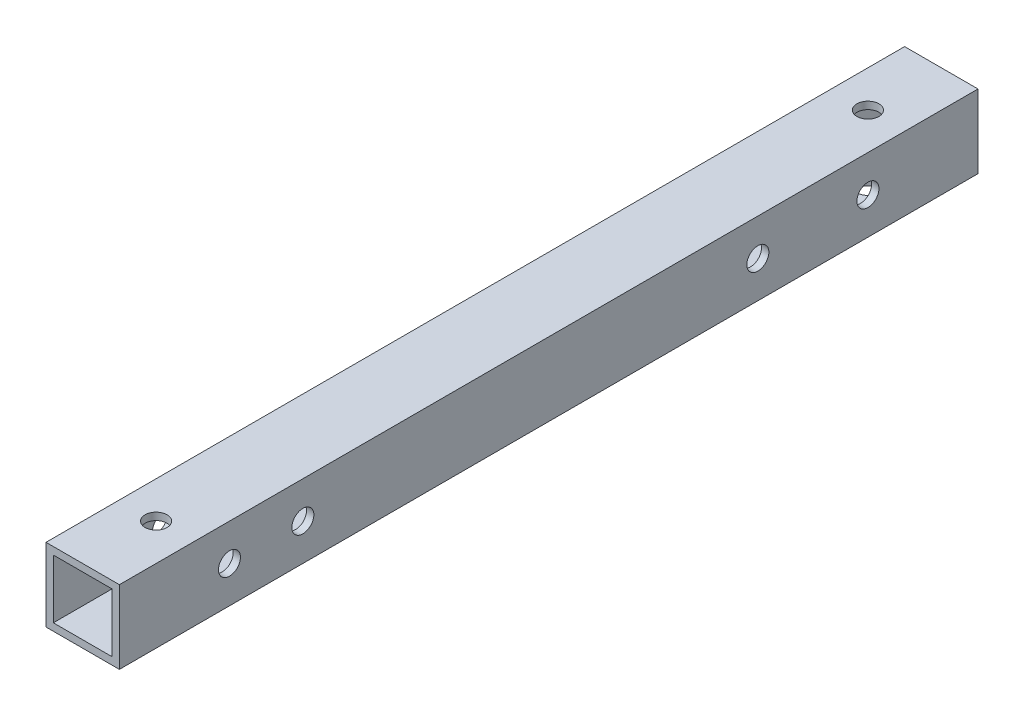
ISO-10303-21;
HEADER;
FILE_DESCRIPTION(('STEP AP214'),'2;1');
FILE_NAME('part.step','',(''),(''),'','','');
FILE_SCHEMA(('AUTOMOTIVE_DESIGN { 1 0 10303 214 1 1 1 1 }'));
ENDSEC;
DATA;
#1=APPLICATION_CONTEXT('core data for automotive mechanical design processes');
#2=APPLICATION_PROTOCOL_DEFINITION('international standard','automotive_design',2000,#1);
#3=PRODUCT_CONTEXT('',#1,'mechanical');
#4=PRODUCT('Part','Part','',(#3));
#5=PRODUCT_RELATED_PRODUCT_CATEGORY('part','',(#4));
#6=PRODUCT_DEFINITION_FORMATION('','',#4);
#7=PRODUCT_DEFINITION_CONTEXT('part definition',#1,'design');
#8=PRODUCT_DEFINITION('design','',#6,#7);
#9=PRODUCT_DEFINITION_SHAPE('','',#8);
#10=(LENGTH_UNIT() NAMED_UNIT(*) SI_UNIT(.MILLI.,.METRE.));
#11=(NAMED_UNIT(*) PLANE_ANGLE_UNIT() SI_UNIT($,.RADIAN.));
#12=(NAMED_UNIT(*) SI_UNIT($,.STERADIAN.) SOLID_ANGLE_UNIT());
#13=UNCERTAINTY_MEASURE_WITH_UNIT(LENGTH_MEASURE(1.E-05),#10,'distance_accuracy_value','');
#14=(GEOMETRIC_REPRESENTATION_CONTEXT(3) GLOBAL_UNCERTAINTY_ASSIGNED_CONTEXT((#13)) GLOBAL_UNIT_ASSIGNED_CONTEXT((#10,
#11,#12)) REPRESENTATION_CONTEXT('',''));
#15=CARTESIAN_POINT('',(0.,0.,0.));
#16=DIRECTION('',(0.,0.,1.));
#17=DIRECTION('',(1.,0.,0.));
#18=AXIS2_PLACEMENT_3D('',#15,#16,#17);
#19=CARTESIAN_POINT('',(0.,0.,117.));
#20=DIRECTION('',(0.,0.,1.));
#21=DIRECTION('',(1.,0.,0.));
#22=AXIS2_PLACEMENT_3D('',#19,#20,#21);
#23=PLANE('',#22);
#24=DIRECTION('',(0.,-1.,0.));
#25=VECTOR('',#24,1.);
#26=CARTESIAN_POINT('',(-5.,5.,117.));
#27=LINE('',#26,#25);
#28=CARTESIAN_POINT('',(-5.,5.,117.));
#29=VERTEX_POINT('',#28);
#30=CARTESIAN_POINT('',(-5.,-5.,117.));
#31=VERTEX_POINT('',#30);
#32=EDGE_CURVE('E168',#29,#31,#27,.T.);
#33=ORIENTED_EDGE('',*,*,#32,.T.);
#34=DIRECTION('',(1.,0.,0.));
#35=VECTOR('',#34,1.);
#36=CARTESIAN_POINT('',(-5.,-5.,117.));
#37=LINE('',#36,#35);
#38=CARTESIAN_POINT('',(5.,-5.,117.));
#39=VERTEX_POINT('',#38);
#40=EDGE_CURVE('E171',#31,#39,#37,.T.);
#41=ORIENTED_EDGE('',*,*,#40,.T.);
#42=DIRECTION('',(0.,1.,0.));
#43=VECTOR('',#42,1.);
#44=CARTESIAN_POINT('',(5.,5.,117.));
#45=LINE('',#44,#43);
#46=CARTESIAN_POINT('',(5.,5.,117.));
#47=VERTEX_POINT('',#46);
#48=EDGE_CURVE('E174',#39,#47,#45,.T.);
#49=ORIENTED_EDGE('',*,*,#48,.T.);
#50=DIRECTION('',(-1.,0.,0.));
#51=VECTOR('',#50,1.);
#52=CARTESIAN_POINT('',(-5.,5.,117.));
#53=LINE('',#52,#51);
#54=EDGE_CURVE('E176',#47,#29,#53,.T.);
#55=ORIENTED_EDGE('',*,*,#54,.T.);
#56=EDGE_LOOP('',(#33,#41,#49,#55));
#57=FACE_BOUND('',#56,.T.);
#58=DIRECTION('',(1.,0.,0.));
#59=VECTOR('',#58,1.);
#60=CARTESIAN_POINT('',(-5.,-4.,117.));
#61=LINE('',#60,#59);
#62=CARTESIAN_POINT('',(-4.,-4.,117.));
#63=VERTEX_POINT('',#62);
#64=CARTESIAN_POINT('',(4.,-4.,117.));
#65=VERTEX_POINT('',#64);
#66=EDGE_CURVE('E138',#63,#65,#61,.T.);
#67=ORIENTED_EDGE('',*,*,#66,.F.);
#68=DIRECTION('',(0.,-1.,0.));
#69=VECTOR('',#68,1.);
#70=CARTESIAN_POINT('',(-4.,5.,117.));
#71=LINE('',#70,#69);
#72=CARTESIAN_POINT('',(-4.,4.,117.));
#73=VERTEX_POINT('',#72);
#74=EDGE_CURVE('E130',#73,#63,#71,.T.);
#75=ORIENTED_EDGE('',*,*,#74,.F.);
#76=DIRECTION('',(-1.,0.,0.));
#77=VECTOR('',#76,1.);
#78=CARTESIAN_POINT('',(-5.,4.,117.));
#79=LINE('',#78,#77);
#80=CARTESIAN_POINT('',(4.,4.,117.));
#81=VERTEX_POINT('',#80);
#82=EDGE_CURVE('E152',#81,#73,#79,.T.);
#83=ORIENTED_EDGE('',*,*,#82,.F.);
#84=DIRECTION('',(0.,1.,0.));
#85=VECTOR('',#84,1.);
#86=CARTESIAN_POINT('',(4.,5.,117.));
#87=LINE('',#86,#85);
#88=EDGE_CURVE('E150',#65,#81,#87,.T.);
#89=ORIENTED_EDGE('',*,*,#88,.F.);
#90=EDGE_LOOP('',(#67,#75,#83,#89));
#91=FACE_BOUND('',#90,.T.);
#92=ADVANCED_FACE('F63',(#57,#91),#23,.T.);
#93=CARTESIAN_POINT('',(0.,0.,0.));
#94=DIRECTION('',(0.,0.,1.));
#95=DIRECTION('',(1.,0.,0.));
#96=AXIS2_PLACEMENT_3D('',#93,#94,#95);
#97=PLANE('',#96);
#98=DIRECTION('',(0.,-1.,0.));
#99=VECTOR('',#98,1.);
#100=CARTESIAN_POINT('',(-5.,5.,0.));
#101=LINE('',#100,#99);
#102=CARTESIAN_POINT('',(-5.,5.,0.));
#103=VERTEX_POINT('',#102);
#104=CARTESIAN_POINT('',(-5.,-5.,0.));
#105=VERTEX_POINT('',#104);
#106=EDGE_CURVE('E146',#103,#105,#101,.T.);
#107=ORIENTED_EDGE('',*,*,#106,.F.);
#108=DIRECTION('',(-1.,0.,0.));
#109=VECTOR('',#108,1.);
#110=CARTESIAN_POINT('',(-5.,5.,0.));
#111=LINE('',#110,#109);
#112=CARTESIAN_POINT('',(5.,5.,0.));
#113=VERTEX_POINT('',#112);
#114=EDGE_CURVE('E172',#113,#103,#111,.T.);
#115=ORIENTED_EDGE('',*,*,#114,.F.);
#116=DIRECTION('',(0.,1.,0.));
#117=VECTOR('',#116,1.);
#118=CARTESIAN_POINT('',(5.,5.,0.));
#119=LINE('',#118,#117);
#120=CARTESIAN_POINT('',(5.,-5.,0.));
#121=VERTEX_POINT('',#120);
#122=EDGE_CURVE('E183',#121,#113,#119,.T.);
#123=ORIENTED_EDGE('',*,*,#122,.F.);
#124=DIRECTION('',(1.,0.,0.));
#125=VECTOR('',#124,1.);
#126=CARTESIAN_POINT('',(-5.,-5.,0.));
#127=LINE('',#126,#125);
#128=EDGE_CURVE('E181',#105,#121,#127,.T.);
#129=ORIENTED_EDGE('',*,*,#128,.F.);
#130=EDGE_LOOP('',(#107,#115,#123,#129));
#131=FACE_BOUND('',#130,.T.);
#132=DIRECTION('',(0.,-1.,0.));
#133=VECTOR('',#132,1.);
#134=CARTESIAN_POINT('',(-4.,5.,0.));
#135=LINE('',#134,#133);
#136=CARTESIAN_POINT('',(-4.,4.,0.));
#137=VERTEX_POINT('',#136);
#138=CARTESIAN_POINT('',(-4.,-4.,0.));
#139=VERTEX_POINT('',#138);
#140=EDGE_CURVE('E88',#137,#139,#135,.T.);
#141=ORIENTED_EDGE('',*,*,#140,.T.);
#142=DIRECTION('',(1.,0.,0.));
#143=VECTOR('',#142,1.);
#144=CARTESIAN_POINT('',(-5.,-4.,0.));
#145=LINE('',#144,#143);
#146=CARTESIAN_POINT('',(4.,-4.,0.));
#147=VERTEX_POINT('',#146);
#148=EDGE_CURVE('E145',#139,#147,#145,.T.);
#149=ORIENTED_EDGE('',*,*,#148,.T.);
#150=DIRECTION('',(0.,1.,0.));
#151=VECTOR('',#150,1.);
#152=CARTESIAN_POINT('',(4.,5.,0.));
#153=LINE('',#152,#151);
#154=CARTESIAN_POINT('',(4.,4.,0.));
#155=VERTEX_POINT('',#154);
#156=EDGE_CURVE('E160',#147,#155,#153,.T.);
#157=ORIENTED_EDGE('',*,*,#156,.T.);
#158=DIRECTION('',(-1.,0.,0.));
#159=VECTOR('',#158,1.);
#160=CARTESIAN_POINT('',(-5.,4.,0.));
#161=LINE('',#160,#159);
#162=EDGE_CURVE('E139',#155,#137,#161,.T.);
#163=ORIENTED_EDGE('',*,*,#162,.T.);
#164=EDGE_LOOP('',(#141,#149,#157,#163));
#165=FACE_BOUND('',#164,.T.);
#166=ADVANCED_FACE('F272',(#131,#165),#97,.F.);
#167=CARTESIAN_POINT('',(-5.,5.,117.));
#168=DIRECTION('',(1.,0.,0.));
#169=DIRECTION('',(0.,0.,-1.));
#170=AXIS2_PLACEMENT_3D('',#167,#168,#169);
#171=PLANE('',#170);
#172=CARTESIAN_POINT('',(-5.,0.,15.));
#173=DIRECTION('',(1.,0.,0.));
#174=DIRECTION('',(0.,0.,-1.));
#175=AXIS2_PLACEMENT_3D('',#172,#173,#174);
#176=CIRCLE('',#175,1.5);
#177=CARTESIAN_POINT('',(-5.,0.,13.5));
#178=VERTEX_POINT('',#177);
#179=EDGE_CURVE('E205',#178,#178,#176,.T.);
#180=ORIENTED_EDGE('',*,*,#179,.T.);
#181=EDGE_LOOP('',(#180));
#182=FACE_BOUND('',#181,.T.);
#183=CARTESIAN_POINT('',(-5.,0.,92.));
#184=DIRECTION('',(1.,0.,0.));
#185=DIRECTION('',(0.,0.,-1.));
#186=AXIS2_PLACEMENT_3D('',#183,#184,#185);
#187=CIRCLE('',#186,1.5);
#188=CARTESIAN_POINT('',(-5.,0.,90.5));
#189=VERTEX_POINT('',#188);
#190=EDGE_CURVE('E318',#189,#189,#187,.T.);
#191=ORIENTED_EDGE('',*,*,#190,.T.);
#192=EDGE_LOOP('',(#191));
#193=FACE_BOUND('',#192,.T.);
#194=CARTESIAN_POINT('',(-5.,0.,102.));
#195=DIRECTION('',(1.,0.,0.));
#196=DIRECTION('',(0.,0.,-1.));
#197=AXIS2_PLACEMENT_3D('',#194,#195,#196);
#198=CIRCLE('',#197,1.5);
#199=CARTESIAN_POINT('',(-5.,0.,100.5));
#200=VERTEX_POINT('',#199);
#201=EDGE_CURVE('E321',#200,#200,#198,.T.);
#202=ORIENTED_EDGE('',*,*,#201,.T.);
#203=EDGE_LOOP('',(#202));
#204=FACE_BOUND('',#203,.T.);
#205=CARTESIAN_POINT('',(-5.,0.,30.));
#206=DIRECTION('',(1.,0.,0.));
#207=DIRECTION('',(0.,0.,-1.));
#208=AXIS2_PLACEMENT_3D('',#205,#206,#207);
#209=CIRCLE('',#208,1.5);
#210=CARTESIAN_POINT('',(-5.,0.,28.5));
#211=VERTEX_POINT('',#210);
#212=EDGE_CURVE('E312',#211,#211,#209,.T.);
#213=ORIENTED_EDGE('',*,*,#212,.T.);
#214=EDGE_LOOP('',(#213));
#215=FACE_BOUND('',#214,.T.);
#216=ORIENTED_EDGE('',*,*,#106,.T.);
#217=DIRECTION('',(0.,0.,-1.));
#218=VECTOR('',#217,1.);
#219=CARTESIAN_POINT('',(-5.,-5.,117.));
#220=LINE('',#219,#218);
#221=EDGE_CURVE('E12',#31,#105,#220,.T.);
#222=ORIENTED_EDGE('',*,*,#221,.F.);
#223=ORIENTED_EDGE('',*,*,#32,.F.);
#224=DIRECTION('',(0.,0.,-1.));
#225=VECTOR('',#224,1.);
#226=CARTESIAN_POINT('',(-5.,5.,117.));
#227=LINE('',#226,#225);
#228=EDGE_CURVE('E178',#29,#103,#227,.T.);
#229=ORIENTED_EDGE('',*,*,#228,.T.);
#230=EDGE_LOOP('',(#216,#222,#223,#229));
#231=FACE_BOUND('',#230,.T.);
#232=ADVANCED_FACE('F65',(#182,#193,#204,#215,#231),#171,.F.);
#233=CARTESIAN_POINT('',(-5.,-5.,117.));
#234=DIRECTION('',(0.,1.,0.));
#235=DIRECTION('',(0.,0.,1.));
#236=AXIS2_PLACEMENT_3D('',#233,#234,#235);
#237=PLANE('',#236);
#238=CARTESIAN_POINT('',(0.,-5.,9.99999999999999));
#239=DIRECTION('',(0.,1.,0.));
#240=DIRECTION('',(0.,0.,1.));
#241=AXIS2_PLACEMENT_3D('',#238,#239,#240);
#242=CIRCLE('',#241,1.5);
#243=CARTESIAN_POINT('',(0.,-5.,11.5));
#244=VERTEX_POINT('',#243);
#245=EDGE_CURVE('E197',#244,#244,#242,.T.);
#246=ORIENTED_EDGE('',*,*,#245,.T.);
#247=EDGE_LOOP('',(#246));
#248=FACE_BOUND('',#247,.T.);
#249=CARTESIAN_POINT('',(0.,-5.,107.));
#250=DIRECTION('',(0.,1.,0.));
#251=DIRECTION('',(0.,0.,1.));
#252=AXIS2_PLACEMENT_3D('',#249,#250,#251);
#253=CIRCLE('',#252,1.5);
#254=CARTESIAN_POINT('',(0.,-5.,108.5));
#255=VERTEX_POINT('',#254);
#256=EDGE_CURVE('E226',#255,#255,#253,.T.);
#257=ORIENTED_EDGE('',*,*,#256,.T.);
#258=EDGE_LOOP('',(#257));
#259=FACE_BOUND('',#258,.T.);
#260=ORIENTED_EDGE('',*,*,#128,.T.);
#261=DIRECTION('',(0.,0.,-1.));
#262=VECTOR('',#261,1.);
#263=CARTESIAN_POINT('',(5.,-5.,117.));
#264=LINE('',#263,#262);
#265=EDGE_CURVE('E72',#39,#121,#264,.T.);
#266=ORIENTED_EDGE('',*,*,#265,.F.);
#267=ORIENTED_EDGE('',*,*,#40,.F.);
#268=ORIENTED_EDGE('',*,*,#221,.T.);
#269=EDGE_LOOP('',(#260,#266,#267,#268));
#270=FACE_BOUND('',#269,.T.);
#271=ADVANCED_FACE('F258',(#248,#259,#270),#237,.F.);
#272=CARTESIAN_POINT('',(5.,5.,117.));
#273=DIRECTION('',(-1.,0.,0.));
#274=DIRECTION('',(0.,0.,1.));
#275=AXIS2_PLACEMENT_3D('',#272,#273,#274);
#276=PLANE('',#275);
#277=CARTESIAN_POINT('',(5.,0.,15.));
#278=DIRECTION('',(1.,0.,0.));
#279=DIRECTION('',(0.,0.,-1.));
#280=AXIS2_PLACEMENT_3D('',#277,#278,#279);
#281=CIRCLE('',#280,1.5);
#282=CARTESIAN_POINT('',(5.,0.,13.5));
#283=VERTEX_POINT('',#282);
#284=EDGE_CURVE('E299',#283,#283,#281,.T.);
#285=ORIENTED_EDGE('',*,*,#284,.F.);
#286=EDGE_LOOP('',(#285));
#287=FACE_BOUND('',#286,.T.);
#288=CARTESIAN_POINT('',(5.,0.,92.));
#289=DIRECTION('',(1.,0.,0.));
#290=DIRECTION('',(0.,0.,-1.));
#291=AXIS2_PLACEMENT_3D('',#288,#289,#290);
#292=CIRCLE('',#291,1.5);
#293=CARTESIAN_POINT('',(5.,0.,90.5));
#294=VERTEX_POINT('',#293);
#295=EDGE_CURVE('E303',#294,#294,#292,.T.);
#296=ORIENTED_EDGE('',*,*,#295,.F.);
#297=EDGE_LOOP('',(#296));
#298=FACE_BOUND('',#297,.T.);
#299=CARTESIAN_POINT('',(5.,0.,102.));
#300=DIRECTION('',(1.,0.,0.));
#301=DIRECTION('',(0.,0.,-1.));
#302=AXIS2_PLACEMENT_3D('',#299,#300,#301);
#303=CIRCLE('',#302,1.5);
#304=CARTESIAN_POINT('',(5.,0.,100.5));
#305=VERTEX_POINT('',#304);
#306=EDGE_CURVE('E307',#305,#305,#303,.T.);
#307=ORIENTED_EDGE('',*,*,#306,.F.);
#308=EDGE_LOOP('',(#307));
#309=FACE_BOUND('',#308,.T.);
#310=CARTESIAN_POINT('',(5.,0.,30.));
#311=DIRECTION('',(1.,0.,0.));
#312=DIRECTION('',(0.,0.,-1.));
#313=AXIS2_PLACEMENT_3D('',#310,#311,#312);
#314=CIRCLE('',#313,1.5);
#315=CARTESIAN_POINT('',(5.,0.,28.5));
#316=VERTEX_POINT('',#315);
#317=EDGE_CURVE('E310',#316,#316,#314,.T.);
#318=ORIENTED_EDGE('',*,*,#317,.F.);
#319=EDGE_LOOP('',(#318));
#320=FACE_BOUND('',#319,.T.);
#321=ORIENTED_EDGE('',*,*,#122,.T.);
#322=DIRECTION('',(0.,0.,-1.));
#323=VECTOR('',#322,1.);
#324=CARTESIAN_POINT('',(5.,5.,117.));
#325=LINE('',#324,#323);
#326=EDGE_CURVE('E188',#47,#113,#325,.T.);
#327=ORIENTED_EDGE('',*,*,#326,.F.);
#328=ORIENTED_EDGE('',*,*,#48,.F.);
#329=ORIENTED_EDGE('',*,*,#265,.T.);
#330=EDGE_LOOP('',(#321,#327,#328,#329));
#331=FACE_BOUND('',#330,.T.);
#332=ADVANCED_FACE('F261',(#287,#298,#309,#320,#331),#276,.F.);
#333=CARTESIAN_POINT('',(-5.,5.,117.));
#334=DIRECTION('',(0.,-1.,0.));
#335=DIRECTION('',(0.,0.,-1.));
#336=AXIS2_PLACEMENT_3D('',#333,#334,#335);
#337=PLANE('',#336);
#338=CARTESIAN_POINT('',(0.,5.,9.99999999999999));
#339=DIRECTION('',(0.,1.,0.));
#340=DIRECTION('',(0.,0.,1.));
#341=AXIS2_PLACEMENT_3D('',#338,#339,#340);
#342=CIRCLE('',#341,1.5);
#343=CARTESIAN_POINT('',(0.,5.,11.5));
#344=VERTEX_POINT('',#343);
#345=EDGE_CURVE('E229',#344,#344,#342,.T.);
#346=ORIENTED_EDGE('',*,*,#345,.F.);
#347=EDGE_LOOP('',(#346));
#348=FACE_BOUND('',#347,.T.);
#349=CARTESIAN_POINT('',(0.,5.,107.));
#350=DIRECTION('',(0.,1.,0.));
#351=DIRECTION('',(0.,0.,1.));
#352=AXIS2_PLACEMENT_3D('',#349,#350,#351);
#353=CIRCLE('',#352,1.5);
#354=CARTESIAN_POINT('',(0.,5.,108.5));
#355=VERTEX_POINT('',#354);
#356=EDGE_CURVE('E232',#355,#355,#353,.T.);
#357=ORIENTED_EDGE('',*,*,#356,.F.);
#358=EDGE_LOOP('',(#357));
#359=FACE_BOUND('',#358,.T.);
#360=ORIENTED_EDGE('',*,*,#114,.T.);
#361=ORIENTED_EDGE('',*,*,#228,.F.);
#362=ORIENTED_EDGE('',*,*,#54,.F.);
#363=ORIENTED_EDGE('',*,*,#326,.T.);
#364=EDGE_LOOP('',(#360,#361,#362,#363));
#365=FACE_BOUND('',#364,.T.);
#366=ADVANCED_FACE('F276',(#348,#359,#365),#337,.F.);
#367=CARTESIAN_POINT('',(-4.,5.,117.));
#368=DIRECTION('',(1.,0.,0.));
#369=DIRECTION('',(0.,0.,-1.));
#370=AXIS2_PLACEMENT_3D('',#367,#368,#369);
#371=PLANE('',#370);
#372=CARTESIAN_POINT('',(-4.,0.,15.));
#373=DIRECTION('',(1.,0.,0.));
#374=DIRECTION('',(0.,0.,-1.));
#375=AXIS2_PLACEMENT_3D('',#372,#373,#374);
#376=CIRCLE('',#375,1.5);
#377=CARTESIAN_POINT('',(-4.,0.,13.5));
#378=VERTEX_POINT('',#377);
#379=EDGE_CURVE('E223',#378,#378,#376,.T.);
#380=ORIENTED_EDGE('',*,*,#379,.F.);
#381=EDGE_LOOP('',(#380));
#382=FACE_BOUND('',#381,.T.);
#383=CARTESIAN_POINT('',(-4.,0.,92.));
#384=DIRECTION('',(1.,0.,0.));
#385=DIRECTION('',(0.,0.,-1.));
#386=AXIS2_PLACEMENT_3D('',#383,#384,#385);
#387=CIRCLE('',#386,1.5);
#388=CARTESIAN_POINT('',(-4.,0.,90.5));
#389=VERTEX_POINT('',#388);
#390=EDGE_CURVE('E211',#389,#389,#387,.T.);
#391=ORIENTED_EDGE('',*,*,#390,.F.);
#392=EDGE_LOOP('',(#391));
#393=FACE_BOUND('',#392,.T.);
#394=CARTESIAN_POINT('',(-4.,0.,102.));
#395=DIRECTION('',(1.,0.,0.));
#396=DIRECTION('',(0.,0.,-1.));
#397=AXIS2_PLACEMENT_3D('',#394,#395,#396);
#398=CIRCLE('',#397,1.5);
#399=CARTESIAN_POINT('',(-4.,0.,100.5));
#400=VERTEX_POINT('',#399);
#401=EDGE_CURVE('E208',#400,#400,#398,.T.);
#402=ORIENTED_EDGE('',*,*,#401,.F.);
#403=EDGE_LOOP('',(#402));
#404=FACE_BOUND('',#403,.T.);
#405=CARTESIAN_POINT('',(-4.,0.,30.));
#406=DIRECTION('',(1.,0.,0.));
#407=DIRECTION('',(0.,0.,-1.));
#408=AXIS2_PLACEMENT_3D('',#405,#406,#407);
#409=CIRCLE('',#408,1.5);
#410=CARTESIAN_POINT('',(-4.,0.,28.5));
#411=VERTEX_POINT('',#410);
#412=EDGE_CURVE('E204',#411,#411,#409,.T.);
#413=ORIENTED_EDGE('',*,*,#412,.F.);
#414=EDGE_LOOP('',(#413));
#415=FACE_BOUND('',#414,.T.);
#416=ORIENTED_EDGE('',*,*,#140,.F.);
#417=DIRECTION('',(0.,0.,-1.));
#418=VECTOR('',#417,1.);
#419=CARTESIAN_POINT('',(-4.,4.,117.));
#420=LINE('',#419,#418);
#421=EDGE_CURVE('E134',#73,#137,#420,.T.);
#422=ORIENTED_EDGE('',*,*,#421,.F.);
#423=ORIENTED_EDGE('',*,*,#74,.T.);
#424=DIRECTION('',(0.,0.,-1.));
#425=VECTOR('',#424,1.);
#426=CARTESIAN_POINT('',(-4.,-4.,117.));
#427=LINE('',#426,#425);
#428=EDGE_CURVE('E133',#63,#139,#427,.T.);
#429=ORIENTED_EDGE('',*,*,#428,.T.);
#430=EDGE_LOOP('',(#416,#422,#423,#429));
#431=FACE_BOUND('',#430,.T.);
#432=ADVANCED_FACE('F132',(#382,#393,#404,#415,#431),#371,.T.);
#433=CARTESIAN_POINT('',(-5.,-4.,117.));
#434=DIRECTION('',(0.,1.,0.));
#435=DIRECTION('',(0.,0.,1.));
#436=AXIS2_PLACEMENT_3D('',#433,#434,#435);
#437=PLANE('',#436);
#438=CARTESIAN_POINT('',(0.,-4.,9.99999999999999));
#439=DIRECTION('',(0.,1.,0.));
#440=DIRECTION('',(0.,0.,1.));
#441=AXIS2_PLACEMENT_3D('',#438,#439,#440);
#442=CIRCLE('',#441,1.5);
#443=CARTESIAN_POINT('',(0.,-4.,11.5));
#444=VERTEX_POINT('',#443);
#445=EDGE_CURVE('E158',#444,#444,#442,.T.);
#446=ORIENTED_EDGE('',*,*,#445,.F.);
#447=EDGE_LOOP('',(#446));
#448=FACE_BOUND('',#447,.T.);
#449=CARTESIAN_POINT('',(0.,-4.,107.));
#450=DIRECTION('',(0.,1.,0.));
#451=DIRECTION('',(0.,0.,1.));
#452=AXIS2_PLACEMENT_3D('',#449,#450,#451);
#453=CIRCLE('',#452,1.5);
#454=CARTESIAN_POINT('',(0.,-4.,108.5));
#455=VERTEX_POINT('',#454);
#456=EDGE_CURVE('E196',#455,#455,#453,.T.);
#457=ORIENTED_EDGE('',*,*,#456,.F.);
#458=EDGE_LOOP('',(#457));
#459=FACE_BOUND('',#458,.T.);
#460=ORIENTED_EDGE('',*,*,#148,.F.);
#461=ORIENTED_EDGE('',*,*,#428,.F.);
#462=ORIENTED_EDGE('',*,*,#66,.T.);
#463=DIRECTION('',(0.,0.,-1.));
#464=VECTOR('',#463,1.);
#465=CARTESIAN_POINT('',(4.,-4.,117.));
#466=LINE('',#465,#464);
#467=EDGE_CURVE('E147',#65,#147,#466,.T.);
#468=ORIENTED_EDGE('',*,*,#467,.T.);
#469=EDGE_LOOP('',(#460,#461,#462,#468));
#470=FACE_BOUND('',#469,.T.);
#471=ADVANCED_FACE('F142',(#448,#459,#470),#437,.T.);
#472=CARTESIAN_POINT('',(4.,5.,117.));
#473=DIRECTION('',(-1.,0.,0.));
#474=DIRECTION('',(0.,0.,1.));
#475=AXIS2_PLACEMENT_3D('',#472,#473,#474);
#476=PLANE('',#475);
#477=CARTESIAN_POINT('',(4.00000000000001,0.,15.));
#478=DIRECTION('',(-1.,0.,0.));
#479=DIRECTION('',(0.,0.,1.));
#480=AXIS2_PLACEMENT_3D('',#477,#478,#479);
#481=CIRCLE('',#480,1.5);
#482=CARTESIAN_POINT('',(4.00000000000001,0.,16.5));
#483=VERTEX_POINT('',#482);
#484=EDGE_CURVE('E67',#483,#483,#481,.T.);
#485=ORIENTED_EDGE('',*,*,#484,.F.);
#486=EDGE_LOOP('',(#485));
#487=FACE_BOUND('',#486,.T.);
#488=CARTESIAN_POINT('',(4.00000000000001,0.,92.));
#489=DIRECTION('',(-1.,0.,0.));
#490=DIRECTION('',(0.,0.,1.));
#491=AXIS2_PLACEMENT_3D('',#488,#489,#490);
#492=CIRCLE('',#491,1.5);
#493=CARTESIAN_POINT('',(4.00000000000001,0.,93.5));
#494=VERTEX_POINT('',#493);
#495=EDGE_CURVE('E209',#494,#494,#492,.T.);
#496=ORIENTED_EDGE('',*,*,#495,.F.);
#497=EDGE_LOOP('',(#496));
#498=FACE_BOUND('',#497,.T.);
#499=CARTESIAN_POINT('',(4.00000000000001,0.,102.));
#500=DIRECTION('',(-1.,0.,0.));
#501=DIRECTION('',(0.,0.,1.));
#502=AXIS2_PLACEMENT_3D('',#499,#500,#501);
#503=CIRCLE('',#502,1.5);
#504=CARTESIAN_POINT('',(4.00000000000001,0.,103.5));
#505=VERTEX_POINT('',#504);
#506=EDGE_CURVE('E206',#505,#505,#503,.T.);
#507=ORIENTED_EDGE('',*,*,#506,.F.);
#508=EDGE_LOOP('',(#507));
#509=FACE_BOUND('',#508,.T.);
#510=CARTESIAN_POINT('',(4.00000000000001,0.,30.));
#511=DIRECTION('',(-1.,0.,0.));
#512=DIRECTION('',(0.,0.,1.));
#513=AXIS2_PLACEMENT_3D('',#510,#511,#512);
#514=CIRCLE('',#513,1.5);
#515=CARTESIAN_POINT('',(4.00000000000001,0.,31.5));
#516=VERTEX_POINT('',#515);
#517=EDGE_CURVE('E201',#516,#516,#514,.T.);
#518=ORIENTED_EDGE('',*,*,#517,.F.);
#519=EDGE_LOOP('',(#518));
#520=FACE_BOUND('',#519,.T.);
#521=ORIENTED_EDGE('',*,*,#156,.F.);
#522=ORIENTED_EDGE('',*,*,#467,.F.);
#523=ORIENTED_EDGE('',*,*,#88,.T.);
#524=DIRECTION('',(0.,0.,-1.));
#525=VECTOR('',#524,1.);
#526=CARTESIAN_POINT('',(4.,4.,117.));
#527=LINE('',#526,#525);
#528=EDGE_CURVE('E80',#81,#155,#527,.T.);
#529=ORIENTED_EDGE('',*,*,#528,.T.);
#530=EDGE_LOOP('',(#521,#522,#523,#529));
#531=FACE_BOUND('',#530,.T.);
#532=ADVANCED_FACE('F246',(#487,#498,#509,#520,#531),#476,.T.);
#533=CARTESIAN_POINT('',(-5.,4.,117.));
#534=DIRECTION('',(0.,-1.,0.));
#535=DIRECTION('',(0.,0.,-1.));
#536=AXIS2_PLACEMENT_3D('',#533,#534,#535);
#537=PLANE('',#536);
#538=CARTESIAN_POINT('',(0.,4.,9.99999999999999));
#539=DIRECTION('',(0.,-1.,0.));
#540=DIRECTION('',(0.,0.,-1.));
#541=AXIS2_PLACEMENT_3D('',#538,#539,#540);
#542=CIRCLE('',#541,1.5);
#543=CARTESIAN_POINT('',(0.,4.,8.49999999999999));
#544=VERTEX_POINT('',#543);
#545=EDGE_CURVE('E198',#544,#544,#542,.T.);
#546=ORIENTED_EDGE('',*,*,#545,.F.);
#547=EDGE_LOOP('',(#546));
#548=FACE_BOUND('',#547,.T.);
#549=CARTESIAN_POINT('',(0.,4.,107.));
#550=DIRECTION('',(0.,-1.,0.));
#551=DIRECTION('',(0.,0.,-1.));
#552=AXIS2_PLACEMENT_3D('',#549,#550,#551);
#553=CIRCLE('',#552,1.5);
#554=CARTESIAN_POINT('',(0.,4.,105.5));
#555=VERTEX_POINT('',#554);
#556=EDGE_CURVE('E193',#555,#555,#553,.T.);
#557=ORIENTED_EDGE('',*,*,#556,.F.);
#558=EDGE_LOOP('',(#557));
#559=FACE_BOUND('',#558,.T.);
#560=ORIENTED_EDGE('',*,*,#162,.F.);
#561=ORIENTED_EDGE('',*,*,#528,.F.);
#562=ORIENTED_EDGE('',*,*,#82,.T.);
#563=ORIENTED_EDGE('',*,*,#421,.T.);
#564=EDGE_LOOP('',(#560,#561,#562,#563));
#565=FACE_BOUND('',#564,.T.);
#566=ADVANCED_FACE('F363',(#548,#559,#565),#537,.T.);
#567=CARTESIAN_POINT('',(0.,-5.,107.));
#568=DIRECTION('',(0.,1.,0.));
#569=DIRECTION('',(0.,0.,1.));
#570=AXIS2_PLACEMENT_3D('',#567,#568,#569);
#571=CYLINDRICAL_SURFACE('',#570,1.5);
#572=ORIENTED_EDGE('',*,*,#556,.T.);
#573=EDGE_LOOP('',(#572));
#574=FACE_BOUND('',#573,.T.);
#575=ORIENTED_EDGE('',*,*,#356,.T.);
#576=EDGE_LOOP('',(#575));
#577=FACE_BOUND('',#576,.T.);
#578=ADVANCED_FACE('F255',(#574,#577),#571,.F.);
#579=CARTESIAN_POINT('',(0.,-5.,9.99999999999999));
#580=DIRECTION('',(0.,1.,0.));
#581=DIRECTION('',(0.,0.,1.));
#582=AXIS2_PLACEMENT_3D('',#579,#580,#581);
#583=CYLINDRICAL_SURFACE('',#582,1.5);
#584=ORIENTED_EDGE('',*,*,#545,.T.);
#585=EDGE_LOOP('',(#584));
#586=FACE_BOUND('',#585,.T.);
#587=ORIENTED_EDGE('',*,*,#345,.T.);
#588=EDGE_LOOP('',(#587));
#589=FACE_BOUND('',#588,.T.);
#590=ADVANCED_FACE('F253',(#586,#589),#583,.F.);
#591=ORIENTED_EDGE('',*,*,#456,.T.);
#592=EDGE_LOOP('',(#591));
#593=FACE_BOUND('',#592,.T.);
#594=ORIENTED_EDGE('',*,*,#256,.F.);
#595=EDGE_LOOP('',(#594));
#596=FACE_BOUND('',#595,.T.);
#597=ADVANCED_FACE('F250',(#593,#596),#571,.F.);
#598=ORIENTED_EDGE('',*,*,#445,.T.);
#599=EDGE_LOOP('',(#598));
#600=FACE_BOUND('',#599,.T.);
#601=ORIENTED_EDGE('',*,*,#245,.F.);
#602=EDGE_LOOP('',(#601));
#603=FACE_BOUND('',#602,.T.);
#604=ADVANCED_FACE('F241',(#600,#603),#583,.F.);
#605=CARTESIAN_POINT('',(-5.,0.,30.));
#606=DIRECTION('',(1.,0.,0.));
#607=DIRECTION('',(0.,0.,-1.));
#608=AXIS2_PLACEMENT_3D('',#605,#606,#607);
#609=CYLINDRICAL_SURFACE('',#608,1.5);
#610=ORIENTED_EDGE('',*,*,#517,.T.);
#611=EDGE_LOOP('',(#610));
#612=FACE_BOUND('',#611,.T.);
#613=ORIENTED_EDGE('',*,*,#317,.T.);
#614=EDGE_LOOP('',(#613));
#615=FACE_BOUND('',#614,.T.);
#616=ADVANCED_FACE('F355',(#612,#615),#609,.F.);
#617=CARTESIAN_POINT('',(-5.,0.,102.));
#618=DIRECTION('',(1.,0.,0.));
#619=DIRECTION('',(0.,0.,-1.));
#620=AXIS2_PLACEMENT_3D('',#617,#618,#619);
#621=CYLINDRICAL_SURFACE('',#620,1.5);
#622=ORIENTED_EDGE('',*,*,#506,.T.);
#623=EDGE_LOOP('',(#622));
#624=FACE_BOUND('',#623,.T.);
#625=ORIENTED_EDGE('',*,*,#306,.T.);
#626=EDGE_LOOP('',(#625));
#627=FACE_BOUND('',#626,.T.);
#628=ADVANCED_FACE('F356',(#624,#627),#621,.F.);
#629=CARTESIAN_POINT('',(-5.,0.,92.));
#630=DIRECTION('',(1.,0.,0.));
#631=DIRECTION('',(0.,0.,-1.));
#632=AXIS2_PLACEMENT_3D('',#629,#630,#631);
#633=CYLINDRICAL_SURFACE('',#632,1.5);
#634=ORIENTED_EDGE('',*,*,#495,.T.);
#635=EDGE_LOOP('',(#634));
#636=FACE_BOUND('',#635,.T.);
#637=ORIENTED_EDGE('',*,*,#295,.T.);
#638=EDGE_LOOP('',(#637));
#639=FACE_BOUND('',#638,.T.);
#640=ADVANCED_FACE('F345',(#636,#639),#633,.F.);
#641=CARTESIAN_POINT('',(-5.,0.,15.));
#642=DIRECTION('',(1.,0.,0.));
#643=DIRECTION('',(0.,0.,-1.));
#644=AXIS2_PLACEMENT_3D('',#641,#642,#643);
#645=CYLINDRICAL_SURFACE('',#644,1.5);
#646=ORIENTED_EDGE('',*,*,#484,.T.);
#647=EDGE_LOOP('',(#646));
#648=FACE_BOUND('',#647,.T.);
#649=ORIENTED_EDGE('',*,*,#284,.T.);
#650=EDGE_LOOP('',(#649));
#651=FACE_BOUND('',#650,.T.);
#652=ADVANCED_FACE('F338',(#648,#651),#645,.F.);
#653=ORIENTED_EDGE('',*,*,#412,.T.);
#654=EDGE_LOOP('',(#653));
#655=FACE_BOUND('',#654,.T.);
#656=ORIENTED_EDGE('',*,*,#212,.F.);
#657=EDGE_LOOP('',(#656));
#658=FACE_BOUND('',#657,.T.);
#659=ADVANCED_FACE('F347',(#655,#658),#609,.F.);
#660=ORIENTED_EDGE('',*,*,#401,.T.);
#661=EDGE_LOOP('',(#660));
#662=FACE_BOUND('',#661,.T.);
#663=ORIENTED_EDGE('',*,*,#201,.F.);
#664=EDGE_LOOP('',(#663));
#665=FACE_BOUND('',#664,.T.);
#666=ADVANCED_FACE('F342',(#662,#665),#621,.F.);
#667=ORIENTED_EDGE('',*,*,#390,.T.);
#668=EDGE_LOOP('',(#667));
#669=FACE_BOUND('',#668,.T.);
#670=ORIENTED_EDGE('',*,*,#190,.F.);
#671=EDGE_LOOP('',(#670));
#672=FACE_BOUND('',#671,.T.);
#673=ADVANCED_FACE('F335',(#669,#672),#633,.F.);
#674=ORIENTED_EDGE('',*,*,#379,.T.);
#675=EDGE_LOOP('',(#674));
#676=FACE_BOUND('',#675,.T.);
#677=ORIENTED_EDGE('',*,*,#179,.F.);
#678=EDGE_LOOP('',(#677));
#679=FACE_BOUND('',#678,.T.);
#680=ADVANCED_FACE('F333',(#676,#679),#645,.F.);
#681=CLOSED_SHELL('',(#92,#166,#232,#271,#332,#366,#432,#471,#532,#566,#578,#590,#597,#604,#616,
#628,#640,#652,#659,#666,#673,#680));
#682=MANIFOLD_SOLID_BREP('B2',#681);
#683=ADVANCED_BREP_SHAPE_REPRESENTATION('',(#18,#682),#14);
#684=SHAPE_DEFINITION_REPRESENTATION(#9,#683);
ENDSEC;
END-ISO-10303-21;
